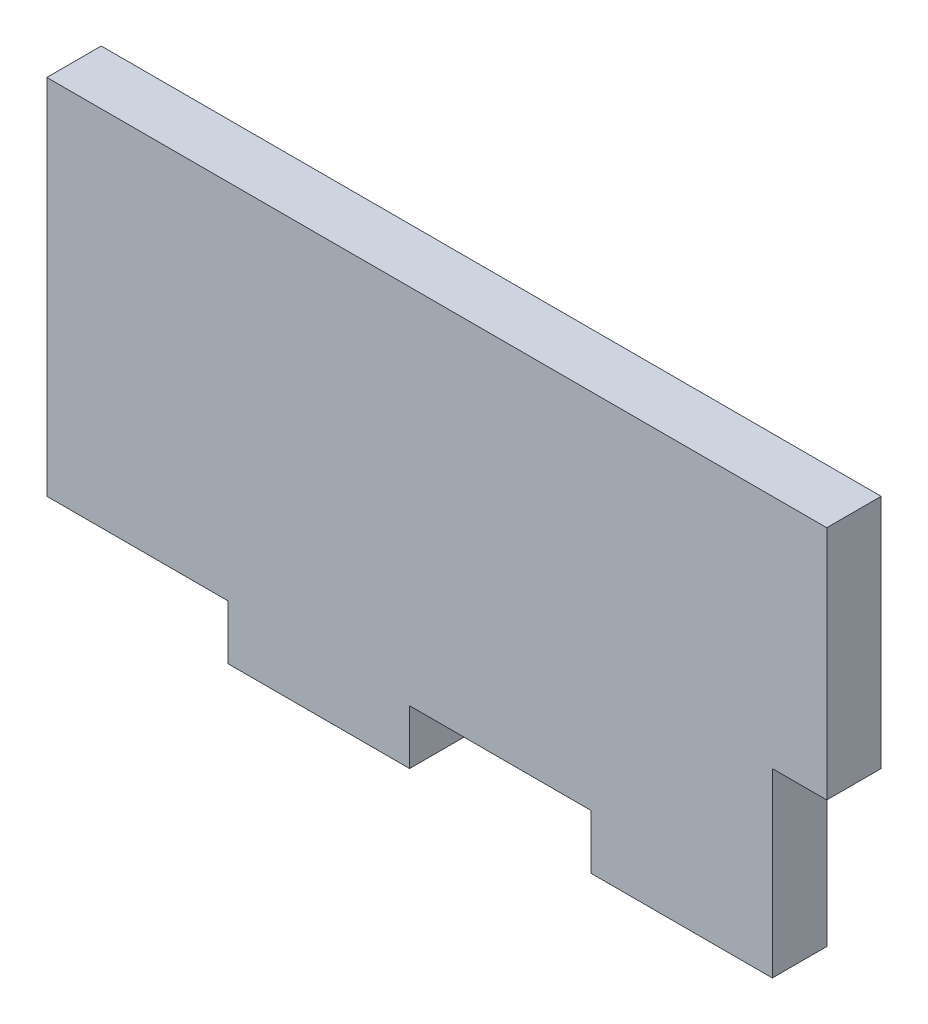
ISO-10303-21;
HEADER;
FILE_DESCRIPTION(('STEP AP214'),'2;1');
FILE_NAME('part.step','',(''),(''),'','','');
FILE_SCHEMA(('AUTOMOTIVE_DESIGN { 1 0 10303 214 1 1 1 1 }'));
ENDSEC;
DATA;
#1=APPLICATION_CONTEXT('core data for automotive mechanical design processes');
#2=APPLICATION_PROTOCOL_DEFINITION('international standard','automotive_design',2000,#1);
#3=PRODUCT_CONTEXT('',#1,'mechanical');
#4=PRODUCT('Part','Part','',(#3));
#5=PRODUCT_RELATED_PRODUCT_CATEGORY('part','',(#4));
#6=PRODUCT_DEFINITION_FORMATION('','',#4);
#7=PRODUCT_DEFINITION_CONTEXT('part definition',#1,'design');
#8=PRODUCT_DEFINITION('design','',#6,#7);
#9=PRODUCT_DEFINITION_SHAPE('','',#8);
#10=(LENGTH_UNIT() NAMED_UNIT(*) SI_UNIT(.MILLI.,.METRE.));
#11=(NAMED_UNIT(*) PLANE_ANGLE_UNIT() SI_UNIT($,.RADIAN.));
#12=(NAMED_UNIT(*) SI_UNIT($,.STERADIAN.) SOLID_ANGLE_UNIT());
#13=UNCERTAINTY_MEASURE_WITH_UNIT(LENGTH_MEASURE(1.E-05),#10,'distance_accuracy_value','');
#14=(GEOMETRIC_REPRESENTATION_CONTEXT(3) GLOBAL_UNCERTAINTY_ASSIGNED_CONTEXT((#13)) GLOBAL_UNIT_ASSIGNED_CONTEXT((#10,
#11,#12)) REPRESENTATION_CONTEXT('',''));
#15=CARTESIAN_POINT('',(0.,0.,0.));
#16=DIRECTION('',(0.,0.,1.));
#17=DIRECTION('',(1.,0.,0.));
#18=AXIS2_PLACEMENT_3D('',#15,#16,#17);
#19=CARTESIAN_POINT('',(0.,-23.,3.));
#20=DIRECTION('',(0.,1.,0.));
#21=DIRECTION('',(0.,0.,1.));
#22=AXIS2_PLACEMENT_3D('',#19,#20,#21);
#23=PLANE('',#22);
#24=DIRECTION('',(1.,0.,0.));
#25=VECTOR('',#24,1.);
#26=CARTESIAN_POINT('',(0.,-23.,0.));
#27=LINE('',#26,#25);
#28=CARTESIAN_POINT('',(10.,-23.,0.));
#29=VERTEX_POINT('',#28);
#30=CARTESIAN_POINT('',(20.,-23.,0.));
#31=VERTEX_POINT('',#30);
#32=EDGE_CURVE('E138',#29,#31,#27,.T.);
#33=ORIENTED_EDGE('',*,*,#32,.T.);
#34=DIRECTION('',(0.,0.,1.));
#35=VECTOR('',#34,1.);
#36=CARTESIAN_POINT('',(20.,-23.,0.));
#37=LINE('',#36,#35);
#38=CARTESIAN_POINT('',(20.,-23.,3.));
#39=VERTEX_POINT('',#38);
#40=EDGE_CURVE('E122',#31,#39,#37,.T.);
#41=ORIENTED_EDGE('',*,*,#40,.T.);
#42=DIRECTION('',(1.,0.,0.));
#43=VECTOR('',#42,1.);
#44=CARTESIAN_POINT('',(0.,-23.,3.));
#45=LINE('',#44,#43);
#46=CARTESIAN_POINT('',(10.,-23.,3.));
#47=VERTEX_POINT('',#46);
#48=EDGE_CURVE('E166',#47,#39,#45,.T.);
#49=ORIENTED_EDGE('',*,*,#48,.F.);
#50=DIRECTION('',(0.,0.,1.));
#51=VECTOR('',#50,1.);
#52=CARTESIAN_POINT('',(10.,-23.,0.));
#53=LINE('',#52,#51);
#54=EDGE_CURVE('E144',#29,#47,#53,.T.);
#55=ORIENTED_EDGE('',*,*,#54,.F.);
#56=EDGE_LOOP('',(#33,#41,#49,#55));
#57=FACE_BOUND('',#56,.T.);
#58=ADVANCED_FACE('F33',(#57),#23,.F.);
#59=CARTESIAN_POINT('',(0.,0.,3.));
#60=DIRECTION('',(1.,0.,0.));
#61=DIRECTION('',(0.,1.,0.));
#62=AXIS2_PLACEMENT_3D('',#59,#60,#61);
#63=PLANE('',#62);
#64=DIRECTION('',(0.,-1.,0.));
#65=VECTOR('',#64,1.);
#66=CARTESIAN_POINT('',(0.,0.,0.));
#67=LINE('',#66,#65);
#68=CARTESIAN_POINT('',(0.,0.,0.));
#69=VERTEX_POINT('',#68);
#70=CARTESIAN_POINT('',(0.,-20.,0.));
#71=VERTEX_POINT('',#70);
#72=EDGE_CURVE('E150',#69,#71,#67,.T.);
#73=ORIENTED_EDGE('',*,*,#72,.T.);
#74=DIRECTION('',(0.,0.,1.));
#75=VECTOR('',#74,1.);
#76=CARTESIAN_POINT('',(0.,-20.,0.));
#77=LINE('',#76,#75);
#78=CARTESIAN_POINT('',(0.,-20.,3.));
#79=VERTEX_POINT('',#78);
#80=EDGE_CURVE('E181',#71,#79,#77,.T.);
#81=ORIENTED_EDGE('',*,*,#80,.T.);
#82=DIRECTION('',(0.,-1.,0.));
#83=VECTOR('',#82,1.);
#84=CARTESIAN_POINT('',(0.,0.,3.));
#85=LINE('',#84,#83);
#86=CARTESIAN_POINT('',(0.,0.,3.));
#87=VERTEX_POINT('',#86);
#88=EDGE_CURVE('E154',#87,#79,#85,.T.);
#89=ORIENTED_EDGE('',*,*,#88,.F.);
#90=DIRECTION('',(0.,0.,-1.));
#91=VECTOR('',#90,1.);
#92=CARTESIAN_POINT('',(0.,0.,3.));
#93=LINE('',#92,#91);
#94=EDGE_CURVE('E41',#87,#69,#93,.T.);
#95=ORIENTED_EDGE('',*,*,#94,.T.);
#96=EDGE_LOOP('',(#73,#81,#89,#95));
#97=FACE_BOUND('',#96,.T.);
#98=ADVANCED_FACE('F35',(#97),#63,.F.);
#99=CARTESIAN_POINT('',(30.,-23.,3.));
#100=VERTEX_POINT('',#99);
#101=CARTESIAN_POINT('',(40.,-23.,3.));
#102=VERTEX_POINT('',#101);
#103=EDGE_CURVE('E170',#100,#102,#45,.T.);
#104=ORIENTED_EDGE('',*,*,#103,.F.);
#105=DIRECTION('',(0.,0.,1.));
#106=VECTOR('',#105,1.);
#107=CARTESIAN_POINT('',(30.,-23.,0.));
#108=LINE('',#107,#106);
#109=CARTESIAN_POINT('',(30.,-23.,0.));
#110=VERTEX_POINT('',#109);
#111=EDGE_CURVE('E132',#110,#100,#108,.T.);
#112=ORIENTED_EDGE('',*,*,#111,.F.);
#113=CARTESIAN_POINT('',(40.,-23.,0.));
#114=VERTEX_POINT('',#113);
#115=EDGE_CURVE('E146',#110,#114,#27,.T.);
#116=ORIENTED_EDGE('',*,*,#115,.T.);
#117=DIRECTION('',(0.,0.,-1.));
#118=VECTOR('',#117,1.);
#119=CARTESIAN_POINT('',(40.,-23.,3.));
#120=LINE('',#119,#118);
#121=EDGE_CURVE('E186',#102,#114,#120,.T.);
#122=ORIENTED_EDGE('',*,*,#121,.F.);
#123=EDGE_LOOP('',(#104,#112,#116,#122));
#124=FACE_BOUND('',#123,.T.);
#125=ADVANCED_FACE('F224',(#124),#23,.F.);
#126=CARTESIAN_POINT('',(43.,0.,3.));
#127=DIRECTION('',(-1.,0.,0.));
#128=DIRECTION('',(0.,-1.,0.));
#129=AXIS2_PLACEMENT_3D('',#126,#127,#128);
#130=PLANE('',#129);
#131=DIRECTION('',(0.,1.,0.));
#132=VECTOR('',#131,1.);
#133=CARTESIAN_POINT('',(43.,0.,3.));
#134=LINE('',#133,#132);
#135=CARTESIAN_POINT('',(43.,-13.,3.));
#136=VERTEX_POINT('',#135);
#137=CARTESIAN_POINT('',(43.,0.,3.));
#138=VERTEX_POINT('',#137);
#139=EDGE_CURVE('E162',#136,#138,#134,.T.);
#140=ORIENTED_EDGE('',*,*,#139,.F.);
#141=DIRECTION('',(0.,0.,1.));
#142=VECTOR('',#141,1.);
#143=CARTESIAN_POINT('',(43.,-13.,3.));
#144=LINE('',#143,#142);
#145=CARTESIAN_POINT('',(43.,-13.,0.));
#146=VERTEX_POINT('',#145);
#147=EDGE_CURVE('E178',#146,#136,#144,.T.);
#148=ORIENTED_EDGE('',*,*,#147,.F.);
#149=DIRECTION('',(0.,1.,0.));
#150=VECTOR('',#149,1.);
#151=CARTESIAN_POINT('',(43.,0.,0.));
#152=LINE('',#151,#150);
#153=CARTESIAN_POINT('',(43.,0.,0.));
#154=VERTEX_POINT('',#153);
#155=EDGE_CURVE('E145',#146,#154,#152,.T.);
#156=ORIENTED_EDGE('',*,*,#155,.T.);
#157=DIRECTION('',(0.,0.,-1.));
#158=VECTOR('',#157,1.);
#159=CARTESIAN_POINT('',(43.,0.,3.));
#160=LINE('',#159,#158);
#161=EDGE_CURVE('E11',#138,#154,#160,.T.);
#162=ORIENTED_EDGE('',*,*,#161,.F.);
#163=EDGE_LOOP('',(#140,#148,#156,#162));
#164=FACE_BOUND('',#163,.T.);
#165=ADVANCED_FACE('F241',(#164),#130,.F.);
#166=CARTESIAN_POINT('',(0.,0.,3.));
#167=DIRECTION('',(0.,-1.,0.));
#168=DIRECTION('',(0.,0.,-1.));
#169=AXIS2_PLACEMENT_3D('',#166,#167,#168);
#170=PLANE('',#169);
#171=DIRECTION('',(-1.,0.,0.));
#172=VECTOR('',#171,1.);
#173=CARTESIAN_POINT('',(0.,0.,0.));
#174=LINE('',#173,#172);
#175=EDGE_CURVE('E148',#154,#69,#174,.T.);
#176=ORIENTED_EDGE('',*,*,#175,.T.);
#177=ORIENTED_EDGE('',*,*,#94,.F.);
#178=DIRECTION('',(-1.,0.,0.));
#179=VECTOR('',#178,1.);
#180=CARTESIAN_POINT('',(0.,0.,3.));
#181=LINE('',#180,#179);
#182=EDGE_CURVE('E156',#138,#87,#181,.T.);
#183=ORIENTED_EDGE('',*,*,#182,.F.);
#184=ORIENTED_EDGE('',*,*,#161,.T.);
#185=EDGE_LOOP('',(#176,#177,#183,#184));
#186=FACE_BOUND('',#185,.T.);
#187=ADVANCED_FACE('F243',(#186),#170,.F.);
#188=CARTESIAN_POINT('',(0.,0.,3.));
#189=DIRECTION('',(0.,0.,1.));
#190=DIRECTION('',(1.,0.,0.));
#191=AXIS2_PLACEMENT_3D('',#188,#189,#190);
#192=PLANE('',#191);
#193=DIRECTION('',(0.,-1.,0.));
#194=VECTOR('',#193,1.);
#195=CARTESIAN_POINT('',(20.,-23.,3.));
#196=LINE('',#195,#194);
#197=CARTESIAN_POINT('',(20.,-20.,3.));
#198=VERTEX_POINT('',#197);
#199=EDGE_CURVE('E127',#198,#39,#196,.T.);
#200=ORIENTED_EDGE('',*,*,#199,.F.);
#201=DIRECTION('',(-1.,0.,0.));
#202=VECTOR('',#201,1.);
#203=CARTESIAN_POINT('',(20.,-20.,3.));
#204=LINE('',#203,#202);
#205=CARTESIAN_POINT('',(30.,-20.,3.));
#206=VERTEX_POINT('',#205);
#207=EDGE_CURVE('E141',#206,#198,#204,.T.);
#208=ORIENTED_EDGE('',*,*,#207,.F.);
#209=DIRECTION('',(0.,1.,0.));
#210=VECTOR('',#209,1.);
#211=CARTESIAN_POINT('',(30.,-23.,3.));
#212=LINE('',#211,#210);
#213=EDGE_CURVE('E211',#100,#206,#212,.T.);
#214=ORIENTED_EDGE('',*,*,#213,.F.);
#215=ORIENTED_EDGE('',*,*,#103,.T.);
#216=DIRECTION('',(0.,-1.,0.));
#217=VECTOR('',#216,1.);
#218=CARTESIAN_POINT('',(40.,-23.,3.));
#219=LINE('',#218,#217);
#220=CARTESIAN_POINT('',(40.,-13.,3.));
#221=VERTEX_POINT('',#220);
#222=EDGE_CURVE('E180',#221,#102,#219,.T.);
#223=ORIENTED_EDGE('',*,*,#222,.F.);
#224=DIRECTION('',(1.,0.,0.));
#225=VECTOR('',#224,1.);
#226=CARTESIAN_POINT('',(40.,-13.,3.));
#227=LINE('',#226,#225);
#228=EDGE_CURVE('E174',#221,#136,#227,.T.);
#229=ORIENTED_EDGE('',*,*,#228,.T.);
#230=ORIENTED_EDGE('',*,*,#139,.T.);
#231=ORIENTED_EDGE('',*,*,#182,.T.);
#232=ORIENTED_EDGE('',*,*,#88,.T.);
#233=DIRECTION('',(-1.,0.,0.));
#234=VECTOR('',#233,1.);
#235=CARTESIAN_POINT('',(0.,-20.,3.));
#236=LINE('',#235,#234);
#237=CARTESIAN_POINT('',(10.,-20.,3.));
#238=VERTEX_POINT('',#237);
#239=EDGE_CURVE('E196',#238,#79,#236,.T.);
#240=ORIENTED_EDGE('',*,*,#239,.F.);
#241=DIRECTION('',(0.,1.,0.));
#242=VECTOR('',#241,1.);
#243=CARTESIAN_POINT('',(10.,-23.,3.));
#244=LINE('',#243,#242);
#245=EDGE_CURVE('E199',#47,#238,#244,.T.);
#246=ORIENTED_EDGE('',*,*,#245,.F.);
#247=ORIENTED_EDGE('',*,*,#48,.T.);
#248=EDGE_LOOP('',(#200,#208,#214,#215,#223,#229,#230,#231,#232,#240,#246,#247));
#249=FACE_BOUND('',#248,.T.);
#250=ADVANCED_FACE('F227',(#249),#192,.T.);
#251=CARTESIAN_POINT('',(0.,0.,0.));
#252=DIRECTION('',(0.,0.,1.));
#253=DIRECTION('',(1.,0.,0.));
#254=AXIS2_PLACEMENT_3D('',#251,#252,#253);
#255=PLANE('',#254);
#256=DIRECTION('',(-1.,0.,0.));
#257=VECTOR('',#256,1.);
#258=CARTESIAN_POINT('',(20.,-20.,0.));
#259=LINE('',#258,#257);
#260=CARTESIAN_POINT('',(30.,-20.,0.));
#261=VERTEX_POINT('',#260);
#262=CARTESIAN_POINT('',(20.,-20.,0.));
#263=VERTEX_POINT('',#262);
#264=EDGE_CURVE('E48',#261,#263,#259,.T.);
#265=ORIENTED_EDGE('',*,*,#264,.T.);
#266=DIRECTION('',(0.,-1.,0.));
#267=VECTOR('',#266,1.);
#268=CARTESIAN_POINT('',(20.,-23.,0.));
#269=LINE('',#268,#267);
#270=EDGE_CURVE('E125',#263,#31,#269,.T.);
#271=ORIENTED_EDGE('',*,*,#270,.T.);
#272=ORIENTED_EDGE('',*,*,#32,.F.);
#273=DIRECTION('',(0.,1.,0.));
#274=VECTOR('',#273,1.);
#275=CARTESIAN_POINT('',(10.,-23.,0.));
#276=LINE('',#275,#274);
#277=CARTESIAN_POINT('',(10.,-20.,0.));
#278=VERTEX_POINT('',#277);
#279=EDGE_CURVE('E198',#29,#278,#276,.T.);
#280=ORIENTED_EDGE('',*,*,#279,.T.);
#281=DIRECTION('',(-1.,0.,0.));
#282=VECTOR('',#281,1.);
#283=CARTESIAN_POINT('',(0.,-20.,0.));
#284=LINE('',#283,#282);
#285=EDGE_CURVE('E56',#278,#71,#284,.T.);
#286=ORIENTED_EDGE('',*,*,#285,.T.);
#287=ORIENTED_EDGE('',*,*,#72,.F.);
#288=ORIENTED_EDGE('',*,*,#175,.F.);
#289=ORIENTED_EDGE('',*,*,#155,.F.);
#290=DIRECTION('',(1.,0.,0.));
#291=VECTOR('',#290,1.);
#292=CARTESIAN_POINT('',(40.,-13.,0.));
#293=LINE('',#292,#291);
#294=CARTESIAN_POINT('',(40.,-13.,0.));
#295=VERTEX_POINT('',#294);
#296=EDGE_CURVE('E172',#295,#146,#293,.T.);
#297=ORIENTED_EDGE('',*,*,#296,.F.);
#298=DIRECTION('',(0.,1.,0.));
#299=VECTOR('',#298,1.);
#300=CARTESIAN_POINT('',(40.,-23.,0.));
#301=LINE('',#300,#299);
#302=EDGE_CURVE('E184',#114,#295,#301,.T.);
#303=ORIENTED_EDGE('',*,*,#302,.F.);
#304=ORIENTED_EDGE('',*,*,#115,.F.);
#305=DIRECTION('',(0.,1.,0.));
#306=VECTOR('',#305,1.);
#307=CARTESIAN_POINT('',(30.,-23.,0.));
#308=LINE('',#307,#306);
#309=EDGE_CURVE('E140',#110,#261,#308,.T.);
#310=ORIENTED_EDGE('',*,*,#309,.T.);
#311=EDGE_LOOP('',(#265,#271,#272,#280,#286,#287,#288,#289,#297,#303,#304,#310));
#312=FACE_BOUND('',#311,.T.);
#313=ADVANCED_FACE('F136',(#312),#255,.F.);
#314=CARTESIAN_POINT('',(40.,-13.,3.));
#315=DIRECTION('',(0.,1.,0.));
#316=DIRECTION('',(-1.,0.,0.));
#317=AXIS2_PLACEMENT_3D('',#314,#315,#316);
#318=PLANE('',#317);
#319=ORIENTED_EDGE('',*,*,#147,.T.);
#320=ORIENTED_EDGE('',*,*,#228,.F.);
#321=DIRECTION('',(0.,0.,1.));
#322=VECTOR('',#321,1.);
#323=CARTESIAN_POINT('',(40.,-13.,3.));
#324=LINE('',#323,#322);
#325=EDGE_CURVE('E175',#295,#221,#324,.T.);
#326=ORIENTED_EDGE('',*,*,#325,.F.);
#327=ORIENTED_EDGE('',*,*,#296,.T.);
#328=EDGE_LOOP('',(#319,#320,#326,#327));
#329=FACE_BOUND('',#328,.T.);
#330=ADVANCED_FACE('F234',(#329),#318,.F.);
#331=CARTESIAN_POINT('',(40.,0.,0.));
#332=DIRECTION('',(-1.,0.,0.));
#333=DIRECTION('',(0.,0.,1.));
#334=AXIS2_PLACEMENT_3D('',#331,#332,#333);
#335=PLANE('',#334);
#336=ORIENTED_EDGE('',*,*,#222,.T.);
#337=ORIENTED_EDGE('',*,*,#121,.T.);
#338=ORIENTED_EDGE('',*,*,#302,.T.);
#339=ORIENTED_EDGE('',*,*,#325,.T.);
#340=EDGE_LOOP('',(#336,#337,#338,#339));
#341=FACE_BOUND('',#340,.T.);
#342=ADVANCED_FACE('F230',(#341),#335,.F.);
#343=CARTESIAN_POINT('',(0.,-20.,0.));
#344=DIRECTION('',(0.,1.,0.));
#345=DIRECTION('',(0.,0.,1.));
#346=AXIS2_PLACEMENT_3D('',#343,#344,#345);
#347=PLANE('',#346);
#348=ORIENTED_EDGE('',*,*,#239,.T.);
#349=ORIENTED_EDGE('',*,*,#80,.F.);
#350=ORIENTED_EDGE('',*,*,#285,.F.);
#351=DIRECTION('',(0.,0.,1.));
#352=VECTOR('',#351,1.);
#353=CARTESIAN_POINT('',(10.,-20.,0.));
#354=LINE('',#353,#352);
#355=EDGE_CURVE('E192',#278,#238,#354,.T.);
#356=ORIENTED_EDGE('',*,*,#355,.T.);
#357=EDGE_LOOP('',(#348,#349,#350,#356));
#358=FACE_BOUND('',#357,.T.);
#359=ADVANCED_FACE('F246',(#358),#347,.F.);
#360=CARTESIAN_POINT('',(10.,-23.,0.));
#361=DIRECTION('',(1.,0.,0.));
#362=DIRECTION('',(0.,0.,-1.));
#363=AXIS2_PLACEMENT_3D('',#360,#361,#362);
#364=PLANE('',#363);
#365=ORIENTED_EDGE('',*,*,#245,.T.);
#366=ORIENTED_EDGE('',*,*,#355,.F.);
#367=ORIENTED_EDGE('',*,*,#279,.F.);
#368=ORIENTED_EDGE('',*,*,#54,.T.);
#369=EDGE_LOOP('',(#365,#366,#367,#368));
#370=FACE_BOUND('',#369,.T.);
#371=ADVANCED_FACE('F248',(#370),#364,.F.);
#372=CARTESIAN_POINT('',(20.,-23.,0.));
#373=DIRECTION('',(-1.,0.,0.));
#374=DIRECTION('',(0.,-1.,0.));
#375=AXIS2_PLACEMENT_3D('',#372,#373,#374);
#376=PLANE('',#375);
#377=ORIENTED_EDGE('',*,*,#199,.T.);
#378=ORIENTED_EDGE('',*,*,#40,.F.);
#379=ORIENTED_EDGE('',*,*,#270,.F.);
#380=DIRECTION('',(0.,0.,1.));
#381=VECTOR('',#380,1.);
#382=CARTESIAN_POINT('',(20.,-20.,0.));
#383=LINE('',#382,#381);
#384=EDGE_CURVE('E202',#263,#198,#383,.T.);
#385=ORIENTED_EDGE('',*,*,#384,.T.);
#386=EDGE_LOOP('',(#377,#378,#379,#385));
#387=FACE_BOUND('',#386,.T.);
#388=ADVANCED_FACE('F124',(#387),#376,.F.);
#389=CARTESIAN_POINT('',(20.,-20.,0.));
#390=DIRECTION('',(0.,1.,0.));
#391=DIRECTION('',(0.,0.,1.));
#392=AXIS2_PLACEMENT_3D('',#389,#390,#391);
#393=PLANE('',#392);
#394=ORIENTED_EDGE('',*,*,#207,.T.);
#395=ORIENTED_EDGE('',*,*,#384,.F.);
#396=ORIENTED_EDGE('',*,*,#264,.F.);
#397=DIRECTION('',(0.,0.,1.));
#398=VECTOR('',#397,1.);
#399=CARTESIAN_POINT('',(30.,-20.,0.));
#400=LINE('',#399,#398);
#401=EDGE_CURVE('E206',#261,#206,#400,.T.);
#402=ORIENTED_EDGE('',*,*,#401,.T.);
#403=EDGE_LOOP('',(#394,#395,#396,#402));
#404=FACE_BOUND('',#403,.T.);
#405=ADVANCED_FACE('F255',(#404),#393,.F.);
#406=CARTESIAN_POINT('',(30.,-23.,0.));
#407=DIRECTION('',(1.,0.,0.));
#408=DIRECTION('',(0.,0.,-1.));
#409=AXIS2_PLACEMENT_3D('',#406,#407,#408);
#410=PLANE('',#409);
#411=ORIENTED_EDGE('',*,*,#213,.T.);
#412=ORIENTED_EDGE('',*,*,#401,.F.);
#413=ORIENTED_EDGE('',*,*,#309,.F.);
#414=ORIENTED_EDGE('',*,*,#111,.T.);
#415=EDGE_LOOP('',(#411,#412,#413,#414));
#416=FACE_BOUND('',#415,.T.);
#417=ADVANCED_FACE('F220',(#416),#410,.F.);
#418=CLOSED_SHELL('',(#58,#98,#125,#165,#187,#250,#313,#330,#342,#359,#371,#388,#405,#417));
#419=MANIFOLD_SOLID_BREP('B2',#418);
#420=ADVANCED_BREP_SHAPE_REPRESENTATION('',(#18,#419),#14);
#421=SHAPE_DEFINITION_REPRESENTATION(#9,#420);
ENDSEC;
END-ISO-10303-21;
